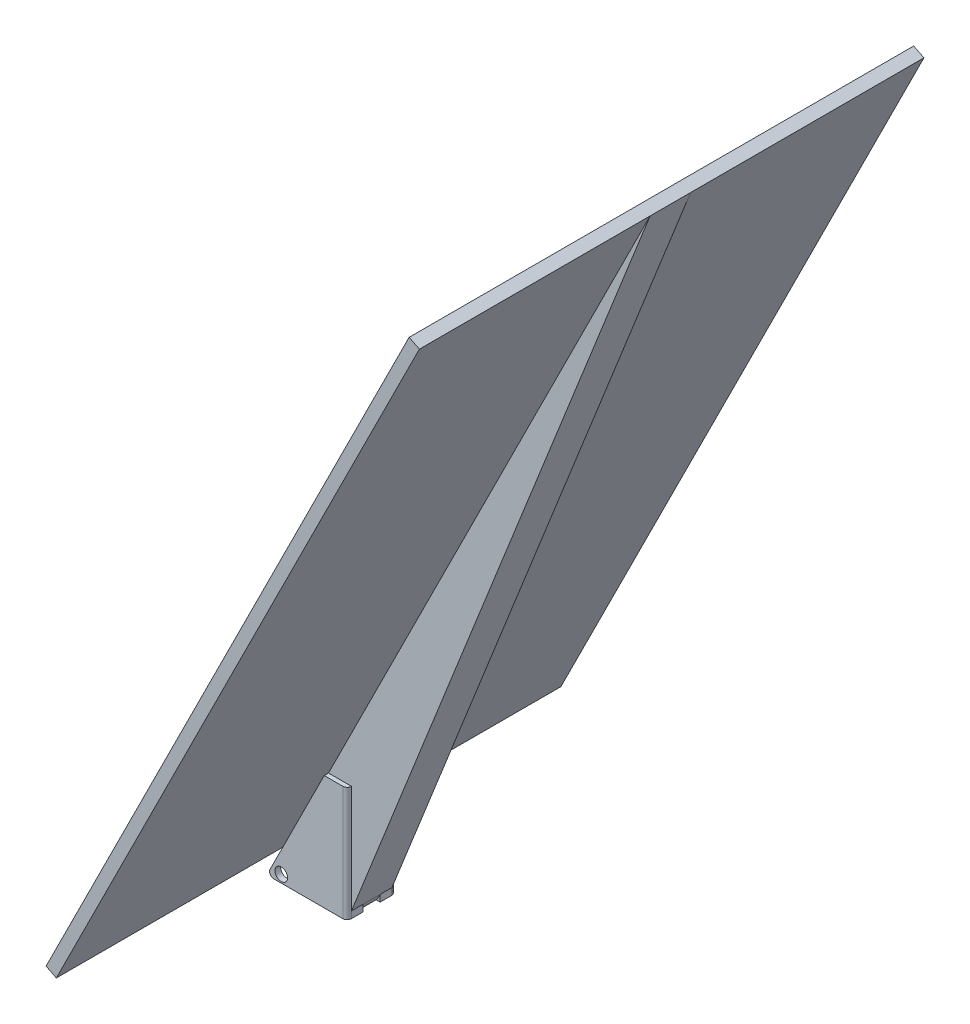
ISO-10303-21;
HEADER;
FILE_DESCRIPTION(('STEP AP214'),'2;1');
FILE_NAME('part.step','',(''),(''),'','','');
FILE_SCHEMA(('AUTOMOTIVE_DESIGN { 1 0 10303 214 1 1 1 1 }'));
ENDSEC;
DATA;
#1=APPLICATION_CONTEXT('core data for automotive mechanical design processes');
#2=APPLICATION_PROTOCOL_DEFINITION('international standard','automotive_design',2000,#1);
#3=PRODUCT_CONTEXT('',#1,'mechanical');
#4=PRODUCT('Part','Part','',(#3));
#5=PRODUCT_RELATED_PRODUCT_CATEGORY('part','',(#4));
#6=PRODUCT_DEFINITION_FORMATION('','',#4);
#7=PRODUCT_DEFINITION_CONTEXT('part definition',#1,'design');
#8=PRODUCT_DEFINITION('design','',#6,#7);
#9=PRODUCT_DEFINITION_SHAPE('','',#8);
#10=(LENGTH_UNIT() NAMED_UNIT(*) SI_UNIT(.MILLI.,.METRE.));
#11=(NAMED_UNIT(*) PLANE_ANGLE_UNIT() SI_UNIT($,.RADIAN.));
#12=(NAMED_UNIT(*) SI_UNIT($,.STERADIAN.) SOLID_ANGLE_UNIT());
#13=UNCERTAINTY_MEASURE_WITH_UNIT(LENGTH_MEASURE(1.E-05),#10,'distance_accuracy_value','');
#14=(GEOMETRIC_REPRESENTATION_CONTEXT(3) GLOBAL_UNCERTAINTY_ASSIGNED_CONTEXT((#13)) GLOBAL_UNIT_ASSIGNED_CONTEXT((#10,
#11,#12)) REPRESENTATION_CONTEXT('',''));
#15=CARTESIAN_POINT('',(0.,0.,0.));
#16=DIRECTION('',(0.,0.,1.));
#17=DIRECTION('',(1.,0.,0.));
#18=AXIS2_PLACEMENT_3D('',#15,#16,#17);
#19=CARTESIAN_POINT('',(23.6636759770968,-11.8318379885484,0.));
#20=DIRECTION('',(-0.894427190999916,0.447213595499958,0.));
#21=DIRECTION('',(-0.447213595499958,-0.894427190999916,0.));
#22=AXIS2_PLACEMENT_3D('',#19,#20,#21);
#23=PLANE('',#22);
#24=DIRECTION('',(0.447213595499958,0.894427190999916,0.));
#25=VECTOR('',#24,1.);
#26=CARTESIAN_POINT('',(8.0426759770968,-43.0738379885484,2.20317749156085));
#27=LINE('',#26,#25);
#28=CARTESIAN_POINT('',(9.51842238139554,-40.1223451799509,2.20317749156085));
#29=VERTEX_POINT('',#28);
#30=CARTESIAN_POINT('',(9.52500000000025,-40.1091899427415,2.20317749156085));
#31=VERTEX_POINT('',#30);
#32=EDGE_CURVE('E401',#29,#31,#27,.T.);
#33=ORIENTED_EDGE('',*,*,#32,.T.);
#34=DIRECTION('',(0.,0.,1.));
#35=VECTOR('',#34,1.);
#36=CARTESIAN_POINT('',(9.525,-40.109189942742,-127.));
#37=LINE('',#36,#35);
#38=CARTESIAN_POINT('',(9.525,-40.109189942742,2.37999999999999));
#39=VERTEX_POINT('',#38);
#40=EDGE_CURVE('E53',#31,#39,#37,.T.);
#41=ORIENTED_EDGE('',*,*,#40,.T.);
#42=CARTESIAN_POINT('',(7.145,-44.869189942742,2.38));
#43=DIRECTION('',(-0.894427190999916,0.447213595499958,0.));
#44=DIRECTION('',(-0.447213595499958,-0.894427190999916,0.));
#45=AXIS2_PLACEMENT_3D('',#42,#43,#44);
#46=ELLIPSE('',#45,5.3218417864495,2.38);
#47=EDGE_CURVE('E428',#29,#39,#46,.F.);
#48=ORIENTED_EDGE('',*,*,#47,.F.);
#49=EDGE_LOOP('',(#33,#41,#48));
#50=FACE_BOUND('',#49,.T.);
#51=ADVANCED_FACE('F38',(#50),#23,.F.);
#52=CARTESIAN_POINT('',(9.525,19.685,26.9875));
#53=DIRECTION('',(0.,-1.,0.));
#54=DIRECTION('',(0.,0.,-1.));
#55=AXIS2_PLACEMENT_3D('',#52,#53,#54);
#56=PLANE('',#55);
#57=DIRECTION('',(1.,0.,0.));
#58=VECTOR('',#57,1.);
#59=CARTESIAN_POINT('',(9.525,19.685,24.6075));
#60=LINE('',#59,#58);
#61=CARTESIAN_POINT('',(-3.175,19.685,24.6075));
#62=VERTEX_POINT('',#61);
#63=CARTESIAN_POINT('',(9.525,19.685,24.6075));
#64=VERTEX_POINT('',#63);
#65=EDGE_CURVE('E421',#62,#64,#60,.T.);
#66=ORIENTED_EDGE('',*,*,#65,.F.);
#67=DIRECTION('',(0.,0.,-1.));
#68=VECTOR('',#67,1.);
#69=CARTESIAN_POINT('',(-3.175,19.685,26.9875));
#70=LINE('',#69,#68);
#71=CARTESIAN_POINT('',(-3.175,19.685,26.9875));
#72=VERTEX_POINT('',#71);
#73=EDGE_CURVE('E242',#72,#62,#70,.T.);
#74=ORIENTED_EDGE('',*,*,#73,.F.);
#75=DIRECTION('',(-1.,0.,0.));
#76=VECTOR('',#75,1.);
#77=CARTESIAN_POINT('',(9.525,19.685,26.9875));
#78=LINE('',#77,#76);
#79=CARTESIAN_POINT('',(7.145,19.685,26.9875));
#80=VERTEX_POINT('',#79);
#81=EDGE_CURVE('E315',#80,#72,#78,.T.);
#82=ORIENTED_EDGE('',*,*,#81,.F.);
#83=CARTESIAN_POINT('',(7.145,19.685,24.6075));
#84=DIRECTION('',(0.,-1.,0.));
#85=DIRECTION('',(0.,0.,-1.));
#86=AXIS2_PLACEMENT_3D('',#83,#84,#85);
#87=CIRCLE('',#86,2.38);
#88=EDGE_CURVE('E342',#80,#64,#87,.F.);
#89=ORIENTED_EDGE('',*,*,#88,.T.);
#90=EDGE_LOOP('',(#66,#74,#82,#89));
#91=FACE_BOUND('',#90,.T.);
#92=ADVANCED_FACE('F478',(#91),#56,.F.);
#93=DIRECTION('',(-1.,0.,0.));
#94=VECTOR('',#93,1.);
#95=CARTESIAN_POINT('',(9.525,19.685,2.20317749156085));
#96=LINE('',#95,#94);
#97=CARTESIAN_POINT('',(9.51842238139554,19.685,2.20317749156085));
#98=VERTEX_POINT('',#97);
#99=CARTESIAN_POINT('',(-3.175,19.685,2.20317749156085));
#100=VERTEX_POINT('',#99);
#101=EDGE_CURVE('E408',#98,#100,#96,.T.);
#102=ORIENTED_EDGE('',*,*,#101,.F.);
#103=CARTESIAN_POINT('',(7.145,19.685,2.38));
#104=DIRECTION('',(0.,-1.,0.));
#105=DIRECTION('',(0.,0.,-1.));
#106=AXIS2_PLACEMENT_3D('',#103,#104,#105);
#107=CIRCLE('',#106,2.38);
#108=CARTESIAN_POINT('',(7.145,19.685,0.));
#109=VERTEX_POINT('',#108);
#110=EDGE_CURVE('E345',#98,#109,#107,.F.);
#111=ORIENTED_EDGE('',*,*,#110,.T.);
#112=DIRECTION('',(-1.,0.,0.));
#113=VECTOR('',#112,1.);
#114=CARTESIAN_POINT('',(9.525,19.685,0.));
#115=LINE('',#114,#113);
#116=CARTESIAN_POINT('',(-3.175,19.685,0.));
#117=VERTEX_POINT('',#116);
#118=EDGE_CURVE('E314',#109,#117,#115,.T.);
#119=ORIENTED_EDGE('',*,*,#118,.T.);
#120=EDGE_CURVE('E333',#100,#117,#70,.T.);
#121=ORIENTED_EDGE('',*,*,#120,.F.);
#122=EDGE_LOOP('',(#102,#111,#119,#121));
#123=FACE_BOUND('',#122,.T.);
#124=ADVANCED_FACE('F484',(#123),#56,.F.);
#125=CARTESIAN_POINT('',(9.525,-43.815,26.9875));
#126=DIRECTION('',(-1.,0.,0.));
#127=DIRECTION('',(0.,0.,1.));
#128=AXIS2_PLACEMENT_3D('',#125,#126,#127);
#129=PLANE('',#128);
#130=DIRECTION('',(0.,0.,-1.));
#131=VECTOR('',#130,1.);
#132=CARTESIAN_POINT('',(9.525,-40.109189942742,26.9875));
#133=LINE('',#132,#131);
#134=CARTESIAN_POINT('',(9.525,-40.109189942742,24.6075));
#135=VERTEX_POINT('',#134);
#136=CARTESIAN_POINT('',(9.525,-40.109189942742,18.25625));
#137=VERTEX_POINT('',#136);
#138=EDGE_CURVE('E423',#135,#137,#133,.T.);
#139=ORIENTED_EDGE('',*,*,#138,.F.);
#140=DIRECTION('',(0.,1.,0.));
#141=VECTOR('',#140,1.);
#142=CARTESIAN_POINT('',(9.525,-43.815,24.6075));
#143=LINE('',#142,#141);
#144=CARTESIAN_POINT('',(9.525,-43.815,24.6075));
#145=VERTEX_POINT('',#144);
#146=EDGE_CURVE('E335',#135,#145,#143,.F.);
#147=ORIENTED_EDGE('',*,*,#146,.T.);
#148=DIRECTION('',(0.,0.,-1.));
#149=VECTOR('',#148,1.);
#150=CARTESIAN_POINT('',(9.525,-43.815,26.9875));
#151=LINE('',#150,#149);
#152=CARTESIAN_POINT('',(9.525,-43.815,18.25625));
#153=VERTEX_POINT('',#152);
#154=EDGE_CURVE('E330',#145,#153,#151,.T.);
#155=ORIENTED_EDGE('',*,*,#154,.T.);
#156=DIRECTION('',(0.,-1.,0.));
#157=VECTOR('',#156,1.);
#158=CARTESIAN_POINT('',(9.525,-43.815,18.25625));
#159=LINE('',#158,#157);
#160=EDGE_CURVE('E273',#137,#153,#159,.T.);
#161=ORIENTED_EDGE('',*,*,#160,.F.);
#162=EDGE_LOOP('',(#139,#147,#155,#161));
#163=FACE_BOUND('',#162,.T.);
#164=ADVANCED_FACE('F550',(#163),#129,.F.);
#165=CARTESIAN_POINT('',(9.525,-40.109189942742,8.73125));
#166=VERTEX_POINT('',#165);
#167=EDGE_CURVE('E426',#166,#39,#133,.T.);
#168=ORIENTED_EDGE('',*,*,#167,.F.);
#169=DIRECTION('',(0.,1.,0.));
#170=VECTOR('',#169,1.);
#171=CARTESIAN_POINT('',(9.525,-43.815,8.73125));
#172=LINE('',#171,#170);
#173=CARTESIAN_POINT('',(9.525,-43.815,8.73125));
#174=VERTEX_POINT('',#173);
#175=EDGE_CURVE('E275',#174,#166,#172,.T.);
#176=ORIENTED_EDGE('',*,*,#175,.F.);
#177=CARTESIAN_POINT('',(9.525,-43.815,2.38));
#178=VERTEX_POINT('',#177);
#179=EDGE_CURVE('E322',#174,#178,#151,.T.);
#180=ORIENTED_EDGE('',*,*,#179,.T.);
#181=DIRECTION('',(0.,1.,0.));
#182=VECTOR('',#181,1.);
#183=CARTESIAN_POINT('',(9.525,19.685,2.38));
#184=LINE('',#183,#182);
#185=EDGE_CURVE('E339',#178,#39,#184,.T.);
#186=ORIENTED_EDGE('',*,*,#185,.T.);
#187=EDGE_LOOP('',(#168,#176,#180,#186));
#188=FACE_BOUND('',#187,.T.);
#189=ADVANCED_FACE('F532',(#188),#129,.F.);
#190=CARTESIAN_POINT('',(-34.925,-43.815,3.175));
#191=DIRECTION('',(0.,0.,-1.));
#192=DIRECTION('',(-1.,0.,0.));
#193=AXIS2_PLACEMENT_3D('',#190,#191,#192);
#194=PLANE('',#193);
#195=CARTESIAN_POINT('',(-26.9654927076154,-39.5437225605806,3.175));
#196=DIRECTION('',(0.,0.,-1.));
#197=DIRECTION('',(-1.,0.,0.));
#198=AXIS2_PLACEMENT_3D('',#195,#196,#197);
#199=CIRCLE('',#198,3.49885);
#200=CARTESIAN_POINT('',(-30.4643427076154,-39.5437225605806,3.175));
#201=VERTEX_POINT('',#200);
#202=EDGE_CURVE('E290',#201,#201,#199,.T.);
#203=ORIENTED_EDGE('',*,*,#202,.T.);
#204=EDGE_LOOP('',(#203));
#205=FACE_BOUND('',#204,.T.);
#206=DIRECTION('',(0.894427190999916,-0.447213595499958,0.));
#207=VECTOR('',#206,1.);
#208=CARTESIAN_POINT('',(-26.035,-26.035,3.175));
#209=LINE('',#208,#207);
#210=CARTESIAN_POINT('',(-26.035,-26.035,3.175));
#211=VERTEX_POINT('',#210);
#212=CARTESIAN_POINT('',(6.34999999999999,-42.2275,3.175));
#213=VERTEX_POINT('',#212);
#214=EDGE_CURVE('E419',#211,#213,#209,.T.);
#215=ORIENTED_EDGE('',*,*,#214,.F.);
#216=DIRECTION('',(-0.447213595499958,-0.894427190999916,0.));
#217=VECTOR('',#216,1.);
#218=CARTESIAN_POINT('',(-34.925,-43.815,3.175));
#219=LINE('',#218,#217);
#220=CARTESIAN_POINT('',(-26.1032999927932,-26.1715999855864,3.175));
#221=VERTEX_POINT('',#220);
#222=EDGE_CURVE('E271',#211,#221,#219,.T.);
#223=ORIENTED_EDGE('',*,*,#222,.T.);
#224=DIRECTION('',(0.447213595499958,0.894427190999916,0.));
#225=VECTOR('',#224,1.);
#226=CARTESIAN_POINT('',(-3.175,19.685,3.175));
#227=LINE('',#226,#225);
#228=CARTESIAN_POINT('',(-33.2028158213551,-40.3706316427101,3.175));
#229=VERTEX_POINT('',#228);
#230=EDGE_CURVE('E311',#229,#221,#227,.T.);
#231=ORIENTED_EDGE('',*,*,#230,.F.);
#232=CARTESIAN_POINT('',(-31.0740791067752,-41.435,3.175));
#233=DIRECTION('',(0.,0.,-1.));
#234=DIRECTION('',(-1.,0.,0.));
#235=AXIS2_PLACEMENT_3D('',#232,#233,#234);
#236=CIRCLE('',#235,2.38);
#237=CARTESIAN_POINT('',(-31.0740791067752,-43.815,3.175));
#238=VERTEX_POINT('',#237);
#239=EDGE_CURVE('E370',#229,#238,#236,.F.);
#240=ORIENTED_EDGE('',*,*,#239,.T.);
#241=DIRECTION('',(-1.,0.,0.));
#242=VECTOR('',#241,1.);
#243=CARTESIAN_POINT('',(-34.925,-43.815,3.175));
#244=LINE('',#243,#242);
#245=CARTESIAN_POINT('',(6.34999999999999,-43.815,3.175));
#246=VERTEX_POINT('',#245);
#247=EDGE_CURVE('E299',#246,#238,#244,.T.);
#248=ORIENTED_EDGE('',*,*,#247,.F.);
#249=DIRECTION('',(0.,1.,0.));
#250=VECTOR('',#249,1.);
#251=CARTESIAN_POINT('',(6.34999999999999,-43.815,3.175));
#252=LINE('',#251,#250);
#253=EDGE_CURVE('E303',#246,#213,#252,.T.);
#254=ORIENTED_EDGE('',*,*,#253,.T.);
#255=EDGE_LOOP('',(#215,#223,#231,#240,#248,#254));
#256=FACE_BOUND('',#255,.T.);
#257=ADVANCED_FACE('F529',(#205,#256),#194,.F.);
#258=CARTESIAN_POINT('',(6.35,-43.815,23.8125));
#259=DIRECTION('',(0.,0.,1.));
#260=DIRECTION('',(1.,0.,0.));
#261=AXIS2_PLACEMENT_3D('',#258,#259,#260);
#262=PLANE('',#261);
#263=CARTESIAN_POINT('',(-26.9654927076154,-39.5437225605806,23.8125));
#264=DIRECTION('',(0.,0.,1.));
#265=DIRECTION('',(1.,0.,0.));
#266=AXIS2_PLACEMENT_3D('',#263,#264,#265);
#267=CIRCLE('',#266,3.49885);
#268=CARTESIAN_POINT('',(-23.4666427076154,-39.5437225605806,23.8125));
#269=VERTEX_POINT('',#268);
#270=EDGE_CURVE('E287',#269,#269,#267,.T.);
#271=ORIENTED_EDGE('',*,*,#270,.T.);
#272=EDGE_LOOP('',(#271));
#273=FACE_BOUND('',#272,.T.);
#274=DIRECTION('',(-0.894427190999916,0.447213595499958,0.));
#275=VECTOR('',#274,1.);
#276=CARTESIAN_POINT('',(6.985,-42.545,23.8125));
#277=LINE('',#276,#275);
#278=CARTESIAN_POINT('',(6.35,-42.2275,23.8125));
#279=VERTEX_POINT('',#278);
#280=CARTESIAN_POINT('',(-26.035,-26.035,23.8125));
#281=VERTEX_POINT('',#280);
#282=EDGE_CURVE('E410',#279,#281,#277,.T.);
#283=ORIENTED_EDGE('',*,*,#282,.F.);
#284=DIRECTION('',(0.,1.,0.));
#285=VECTOR('',#284,1.);
#286=CARTESIAN_POINT('',(6.35,-43.815,23.8125));
#287=LINE('',#286,#285);
#288=CARTESIAN_POINT('',(6.35,-43.815,23.8125));
#289=VERTEX_POINT('',#288);
#290=EDGE_CURVE('E302',#289,#279,#287,.T.);
#291=ORIENTED_EDGE('',*,*,#290,.F.);
#292=DIRECTION('',(1.,0.,0.));
#293=VECTOR('',#292,1.);
#294=CARTESIAN_POINT('',(6.35,-43.815,23.8125));
#295=LINE('',#294,#293);
#296=CARTESIAN_POINT('',(-31.0740791067752,-43.815,23.8125));
#297=VERTEX_POINT('',#296);
#298=EDGE_CURVE('E293',#297,#289,#295,.T.);
#299=ORIENTED_EDGE('',*,*,#298,.F.);
#300=CARTESIAN_POINT('',(-31.0740791067752,-41.435,23.8125));
#301=DIRECTION('',(0.,0.,1.));
#302=DIRECTION('',(1.,0.,0.));
#303=AXIS2_PLACEMENT_3D('',#300,#301,#302);
#304=CIRCLE('',#303,2.38);
#305=CARTESIAN_POINT('',(-33.2028158213551,-40.3706316427101,23.8125));
#306=VERTEX_POINT('',#305);
#307=EDGE_CURVE('E372',#297,#306,#304,.F.);
#308=ORIENTED_EDGE('',*,*,#307,.T.);
#309=DIRECTION('',(-0.447213595499958,-0.894427190999916,0.));
#310=VECTOR('',#309,1.);
#311=CARTESIAN_POINT('',(-3.175,19.685,23.8125));
#312=LINE('',#311,#310);
#313=CARTESIAN_POINT('',(-26.1032999927932,-26.1715999855864,23.8125));
#314=VERTEX_POINT('',#313);
#315=EDGE_CURVE('E306',#314,#306,#312,.T.);
#316=ORIENTED_EDGE('',*,*,#315,.F.);
#317=EDGE_CURVE('E309',#281,#314,#312,.T.);
#318=ORIENTED_EDGE('',*,*,#317,.F.);
#319=EDGE_LOOP('',(#283,#291,#299,#308,#316,#318));
#320=FACE_BOUND('',#319,.T.);
#321=ADVANCED_FACE('F459',(#273,#320),#262,.F.);
#322=CARTESIAN_POINT('',(6.34999999999999,-43.815,3.175));
#323=DIRECTION('',(1.,0.,0.));
#324=DIRECTION('',(0.,0.,-1.));
#325=AXIS2_PLACEMENT_3D('',#322,#323,#324);
#326=PLANE('',#325);
#327=DIRECTION('',(0.,0.,1.));
#328=VECTOR('',#327,1.);
#329=CARTESIAN_POINT('',(6.34999999999999,-42.2275,3.175));
#330=LINE('',#329,#328);
#331=CARTESIAN_POINT('',(6.34999999999999,-42.2275,8.73125));
#332=VERTEX_POINT('',#331);
#333=EDGE_CURVE('E412',#213,#332,#330,.T.);
#334=ORIENTED_EDGE('',*,*,#333,.F.);
#335=ORIENTED_EDGE('',*,*,#253,.F.);
#336=DIRECTION('',(0.,0.,-1.));
#337=VECTOR('',#336,1.);
#338=CARTESIAN_POINT('',(6.34999999999999,-43.815,3.175));
#339=LINE('',#338,#337);
#340=CARTESIAN_POINT('',(6.34999999999999,-43.815,8.73125));
#341=VERTEX_POINT('',#340);
#342=EDGE_CURVE('E295',#341,#246,#339,.T.);
#343=ORIENTED_EDGE('',*,*,#342,.F.);
#344=DIRECTION('',(0.,1.,0.));
#345=VECTOR('',#344,1.);
#346=CARTESIAN_POINT('',(6.35,-43.815,8.73125));
#347=LINE('',#346,#345);
#348=EDGE_CURVE('E381',#341,#332,#347,.T.);
#349=ORIENTED_EDGE('',*,*,#348,.T.);
#350=EDGE_LOOP('',(#334,#335,#343,#349));
#351=FACE_BOUND('',#350,.T.);
#352=ADVANCED_FACE('F534',(#351),#326,.F.);
#353=CARTESIAN_POINT('',(6.35,-42.2275,18.25625));
#354=VERTEX_POINT('',#353);
#355=EDGE_CURVE('E407',#354,#279,#330,.T.);
#356=ORIENTED_EDGE('',*,*,#355,.F.);
#357=DIRECTION('',(0.,-1.,0.));
#358=VECTOR('',#357,1.);
#359=CARTESIAN_POINT('',(6.35,-43.815,18.25625));
#360=LINE('',#359,#358);
#361=CARTESIAN_POINT('',(6.35,-43.815,18.25625));
#362=VERTEX_POINT('',#361);
#363=EDGE_CURVE('E379',#354,#362,#360,.T.);
#364=ORIENTED_EDGE('',*,*,#363,.T.);
#365=EDGE_CURVE('E296',#289,#362,#339,.T.);
#366=ORIENTED_EDGE('',*,*,#365,.F.);
#367=ORIENTED_EDGE('',*,*,#290,.T.);
#368=EDGE_LOOP('',(#356,#364,#366,#367));
#369=FACE_BOUND('',#368,.T.);
#370=ADVANCED_FACE('F537',(#369),#326,.F.);
#371=CARTESIAN_POINT('',(7.145,-43.815,2.38));
#372=DIRECTION('',(0.,-1.,0.));
#373=DIRECTION('',(0.,0.,-1.));
#374=AXIS2_PLACEMENT_3D('',#371,#372,#373);
#375=CYLINDRICAL_SURFACE('',#374,2.38);
#376=ORIENTED_EDGE('',*,*,#110,.F.);
#377=DIRECTION('',(0.,-1.,0.));
#378=VECTOR('',#377,1.);
#379=CARTESIAN_POINT('',(9.51842238139554,-43.815,2.20317749156085));
#380=LINE('',#379,#378);
#381=EDGE_CURVE('E413',#98,#29,#380,.T.);
#382=ORIENTED_EDGE('',*,*,#381,.T.);
#383=ORIENTED_EDGE('',*,*,#47,.T.);
#384=ORIENTED_EDGE('',*,*,#185,.F.);
#385=CARTESIAN_POINT('',(7.145,-43.815,2.38));
#386=DIRECTION('',(0.,1.,0.));
#387=DIRECTION('',(0.,0.,1.));
#388=AXIS2_PLACEMENT_3D('',#385,#386,#387);
#389=CIRCLE('',#388,2.38);
#390=CARTESIAN_POINT('',(7.145,-43.815,0.));
#391=VERTEX_POINT('',#390);
#392=EDGE_CURVE('E353',#391,#178,#389,.F.);
#393=ORIENTED_EDGE('',*,*,#392,.F.);
#394=DIRECTION('',(0.,1.,0.));
#395=VECTOR('',#394,1.);
#396=CARTESIAN_POINT('',(7.145,-43.815,0.));
#397=LINE('',#396,#395);
#398=EDGE_CURVE('E347',#109,#391,#397,.F.);
#399=ORIENTED_EDGE('',*,*,#398,.F.);
#400=EDGE_LOOP('',(#376,#382,#383,#384,#393,#399));
#401=FACE_BOUND('',#400,.T.);
#402=ADVANCED_FACE('F519',(#401),#375,.T.);
#403=CARTESIAN_POINT('',(-33.4540791067752,-43.815,8.73125));
#404=DIRECTION('',(0.,0.,-1.));
#405=DIRECTION('',(-1.,0.,0.));
#406=AXIS2_PLACEMENT_3D('',#403,#404,#405);
#407=PLANE('',#406);
#408=DIRECTION('',(0.894427190999916,-0.447213595499958,0.));
#409=VECTOR('',#408,1.);
#410=CARTESIAN_POINT('',(-24.8582632854202,-26.6233683572899,8.73125));
#411=LINE('',#410,#409);
#412=CARTESIAN_POINT('',(8.0426759770968,-43.0738379885484,8.73125));
#413=VERTEX_POINT('',#412);
#414=EDGE_CURVE('E400',#332,#413,#411,.T.);
#415=ORIENTED_EDGE('',*,*,#414,.F.);
#416=ORIENTED_EDGE('',*,*,#348,.F.);
#417=DIRECTION('',(1.,0.,0.));
#418=VECTOR('',#417,1.);
#419=CARTESIAN_POINT('',(-33.4540791067752,-43.815,8.73125));
#420=LINE('',#419,#418);
#421=EDGE_CURVE('E279',#341,#174,#420,.T.);
#422=ORIENTED_EDGE('',*,*,#421,.T.);
#423=ORIENTED_EDGE('',*,*,#175,.T.);
#424=DIRECTION('',(0.447213595499958,0.894427190999916,0.));
#425=VECTOR('',#424,1.);
#426=CARTESIAN_POINT('',(-0.553139844258248,-60.2654696312585,8.73125));
#427=LINE('',#426,#425);
#428=EDGE_CURVE('E425',#413,#166,#427,.T.);
#429=ORIENTED_EDGE('',*,*,#428,.F.);
#430=EDGE_LOOP('',(#415,#416,#422,#423,#429));
#431=FACE_BOUND('',#430,.T.);
#432=ADVANCED_FACE('F516',(#431),#407,.F.);
#433=CARTESIAN_POINT('',(-33.4540791067752,-43.815,18.25625));
#434=DIRECTION('',(0.,0.,1.));
#435=DIRECTION('',(0.,-1.,0.));
#436=AXIS2_PLACEMENT_3D('',#433,#434,#435);
#437=PLANE('',#436);
#438=DIRECTION('',(-0.894427190999916,0.447213595499958,0.));
#439=VECTOR('',#438,1.);
#440=CARTESIAN_POINT('',(-24.8582632854202,-26.6233683572899,18.25625));
#441=LINE('',#440,#439);
#442=CARTESIAN_POINT('',(8.0426759770968,-43.0738379885484,18.25625));
#443=VERTEX_POINT('',#442);
#444=EDGE_CURVE('E397',#443,#354,#441,.T.);
#445=ORIENTED_EDGE('',*,*,#444,.F.);
#446=DIRECTION('',(-0.447213595499958,-0.894427190999916,0.));
#447=VECTOR('',#446,1.);
#448=CARTESIAN_POINT('',(-0.553139844258248,-60.2654696312585,18.25625));
#449=LINE('',#448,#447);
#450=EDGE_CURVE('E46',#137,#443,#449,.T.);
#451=ORIENTED_EDGE('',*,*,#450,.F.);
#452=ORIENTED_EDGE('',*,*,#160,.T.);
#453=DIRECTION('',(1.,0.,0.));
#454=VECTOR('',#453,1.);
#455=CARTESIAN_POINT('',(-33.4540791067752,-43.815,18.25625));
#456=LINE('',#455,#454);
#457=EDGE_CURVE('E278',#362,#153,#456,.T.);
#458=ORIENTED_EDGE('',*,*,#457,.F.);
#459=ORIENTED_EDGE('',*,*,#363,.F.);
#460=EDGE_LOOP('',(#445,#451,#452,#458,#459));
#461=FACE_BOUND('',#460,.T.);
#462=ADVANCED_FACE('F405',(#461),#437,.F.);
#463=CARTESIAN_POINT('',(-10.414,5.20700000000001,0.));
#464=DIRECTION('',(0.894427190999916,-0.447213595499958,0.));
#465=DIRECTION('',(0.447213595499958,0.894427190999916,0.));
#466=AXIS2_PLACEMENT_3D('',#463,#464,#465);
#467=PLANE('',#466);
#468=ORIENTED_EDGE('',*,*,#73,.T.);
#469=DIRECTION('',(-0.447213595499958,-0.894427190999916,0.));
#470=VECTOR('',#469,1.);
#471=CARTESIAN_POINT('',(-26.035,-26.035,24.6075));
#472=LINE('',#471,#470);
#473=CARTESIAN_POINT('',(174.954988272078,375.944976544156,24.6075));
#474=VERTEX_POINT('',#473);
#475=EDGE_CURVE('E228',#474,#62,#472,.T.);
#476=ORIENTED_EDGE('',*,*,#475,.F.);
#477=DIRECTION('',(0.,0.,-1.));
#478=VECTOR('',#477,1.);
#479=CARTESIAN_POINT('',(174.954988272078,375.944976544156,-127.));
#480=LINE('',#479,#478);
#481=CARTESIAN_POINT('',(174.954988272078,375.944976544156,152.4));
#482=VERTEX_POINT('',#481);
#483=EDGE_CURVE('E239',#482,#474,#480,.T.);
#484=ORIENTED_EDGE('',*,*,#483,.F.);
#485=DIRECTION('',(0.447213595499958,0.894427190999916,0.));
#486=VECTOR('',#485,1.);
#487=CARTESIAN_POINT('',(-26.1032999927932,-26.1715999855864,152.4));
#488=LINE('',#487,#486);
#489=CARTESIAN_POINT('',(-26.1032999927932,-26.1715999855864,152.4));
#490=VERTEX_POINT('',#489);
#491=EDGE_CURVE('E256',#490,#482,#488,.T.);
#492=ORIENTED_EDGE('',*,*,#491,.F.);
#493=DIRECTION('',(0.,0.,1.));
#494=VECTOR('',#493,1.);
#495=CARTESIAN_POINT('',(-26.1032999927932,-26.1715999855864,-127.));
#496=LINE('',#495,#494);
#497=CARTESIAN_POINT('',(-26.1032999927932,-26.1715999855864,26.9875));
#498=VERTEX_POINT('',#497);
#499=EDGE_CURVE('E437',#498,#490,#496,.T.);
#500=ORIENTED_EDGE('',*,*,#499,.F.);
#501=DIRECTION('',(-0.447213595499958,-0.894427190999916,0.));
#502=VECTOR('',#501,1.);
#503=CARTESIAN_POINT('',(-3.175,19.685,26.9875));
#504=LINE('',#503,#502);
#505=EDGE_CURVE('E318',#72,#498,#504,.T.);
#506=ORIENTED_EDGE('',*,*,#505,.F.);
#507=EDGE_LOOP('',(#468,#476,#484,#492,#500,#506));
#508=FACE_BOUND('',#507,.T.);
#509=ADVANCED_FACE('F237',(#508),#467,.T.);
#510=ORIENTED_EDGE('',*,*,#222,.F.);
#511=DIRECTION('',(0.,0.,-1.));
#512=VECTOR('',#511,1.);
#513=CARTESIAN_POINT('',(-26.035,-26.035,24.6075));
#514=LINE('',#513,#512);
#515=EDGE_CURVE('E243',#281,#211,#514,.T.);
#516=ORIENTED_EDGE('',*,*,#515,.F.);
#517=ORIENTED_EDGE('',*,*,#317,.T.);
#518=EDGE_CURVE('E443',#221,#314,#496,.T.);
#519=ORIENTED_EDGE('',*,*,#518,.F.);
#520=EDGE_LOOP('',(#510,#516,#517,#519));
#521=FACE_BOUND('',#520,.T.);
#522=ADVANCED_FACE('F453',(#521),#467,.T.);
#523=CARTESIAN_POINT('',(174.954988272078,375.944976544156,2.20317749156085));
#524=VERTEX_POINT('',#523);
#525=CARTESIAN_POINT('',(174.954988272078,375.944976544156,-127.));
#526=VERTEX_POINT('',#525);
#527=EDGE_CURVE('E251',#524,#526,#480,.T.);
#528=ORIENTED_EDGE('',*,*,#527,.F.);
#529=DIRECTION('',(0.447213595499958,0.894427190999916,0.));
#530=VECTOR('',#529,1.);
#531=CARTESIAN_POINT('',(-26.035,-26.035,2.20317749156085));
#532=LINE('',#531,#530);
#533=EDGE_CURVE('E402',#100,#524,#532,.T.);
#534=ORIENTED_EDGE('',*,*,#533,.F.);
#535=ORIENTED_EDGE('',*,*,#120,.T.);
#536=DIRECTION('',(-0.447213595499958,-0.894427190999916,0.));
#537=VECTOR('',#536,1.);
#538=CARTESIAN_POINT('',(-3.175,19.685,0.));
#539=LINE('',#538,#537);
#540=CARTESIAN_POINT('',(-26.1032999927932,-26.1715999855864,0.));
#541=VERTEX_POINT('',#540);
#542=EDGE_CURVE('E326',#117,#541,#539,.T.);
#543=ORIENTED_EDGE('',*,*,#542,.T.);
#544=CARTESIAN_POINT('',(-26.1032999927932,-26.1715999855864,-127.));
#545=VERTEX_POINT('',#544);
#546=EDGE_CURVE('E438',#545,#541,#496,.T.);
#547=ORIENTED_EDGE('',*,*,#546,.F.);
#548=DIRECTION('',(-0.447213595499958,-0.894427190999916,0.));
#549=VECTOR('',#548,1.);
#550=CARTESIAN_POINT('',(-26.1032999927932,-26.1715999855864,-127.));
#551=LINE('',#550,#549);
#552=EDGE_CURVE('E430',#526,#545,#551,.T.);
#553=ORIENTED_EDGE('',*,*,#552,.F.);
#554=EDGE_LOOP('',(#528,#534,#535,#543,#547,#553));
#555=FACE_BOUND('',#554,.T.);
#556=ADVANCED_FACE('F474',(#555),#467,.T.);
#557=CARTESIAN_POINT('',(-3.175,19.685,26.9875));
#558=DIRECTION('',(0.894427190999916,-0.447213595499958,0.));
#559=DIRECTION('',(0.447213595499958,0.894427190999916,0.));
#560=AXIS2_PLACEMENT_3D('',#557,#558,#559);
#561=PLANE('',#560);
#562=EDGE_CURVE('E440',#541,#221,#496,.T.);
#563=ORIENTED_EDGE('',*,*,#562,.F.);
#564=CARTESIAN_POINT('',(-33.2028158213551,-40.3706316427101,0.));
#565=VERTEX_POINT('',#564);
#566=EDGE_CURVE('E325',#541,#565,#539,.T.);
#567=ORIENTED_EDGE('',*,*,#566,.T.);
#568=DIRECTION('',(0.,0.,-1.));
#569=VECTOR('',#568,1.);
#570=CARTESIAN_POINT('',(-33.2028158213551,-40.3706316427101,26.9875));
#571=LINE('',#570,#569);
#572=EDGE_CURVE('E368',#565,#229,#571,.F.);
#573=ORIENTED_EDGE('',*,*,#572,.T.);
#574=ORIENTED_EDGE('',*,*,#230,.T.);
#575=EDGE_LOOP('',(#563,#567,#573,#574));
#576=FACE_BOUND('',#575,.T.);
#577=ADVANCED_FACE('F465',(#576),#561,.F.);
#578=EDGE_CURVE('E444',#314,#498,#496,.T.);
#579=ORIENTED_EDGE('',*,*,#578,.F.);
#580=ORIENTED_EDGE('',*,*,#315,.T.);
#581=DIRECTION('',(0.,0.,-1.));
#582=VECTOR('',#581,1.);
#583=CARTESIAN_POINT('',(-33.2028158213551,-40.3706316427101,26.9875));
#584=LINE('',#583,#582);
#585=CARTESIAN_POINT('',(-33.2028158213551,-40.3706316427101,26.9875));
#586=VERTEX_POINT('',#585);
#587=EDGE_CURVE('E375',#306,#586,#584,.F.);
#588=ORIENTED_EDGE('',*,*,#587,.T.);
#589=EDGE_CURVE('E60',#498,#586,#504,.T.);
#590=ORIENTED_EDGE('',*,*,#589,.F.);
#591=EDGE_LOOP('',(#579,#580,#588,#590));
#592=FACE_BOUND('',#591,.T.);
#593=ADVANCED_FACE('F462',(#592),#561,.F.);
#594=CARTESIAN_POINT('',(9.525,-43.815,26.9875));
#595=DIRECTION('',(0.,1.,0.));
#596=DIRECTION('',(0.,0.,1.));
#597=AXIS2_PLACEMENT_3D('',#594,#595,#596);
#598=PLANE('',#597);
#599=ORIENTED_EDGE('',*,*,#179,.F.);
#600=ORIENTED_EDGE('',*,*,#421,.F.);
#601=ORIENTED_EDGE('',*,*,#342,.T.);
#602=ORIENTED_EDGE('',*,*,#247,.T.);
#603=DIRECTION('',(0.,0.,-1.));
#604=VECTOR('',#603,1.);
#605=CARTESIAN_POINT('',(-31.0740791067752,-43.815,26.9875));
#606=LINE('',#605,#604);
#607=CARTESIAN_POINT('',(-31.0740791067752,-43.815,0.));
#608=VERTEX_POINT('',#607);
#609=EDGE_CURVE('E362',#238,#608,#606,.T.);
#610=ORIENTED_EDGE('',*,*,#609,.T.);
#611=DIRECTION('',(1.,0.,0.));
#612=VECTOR('',#611,1.);
#613=CARTESIAN_POINT('',(9.525,-43.815,0.));
#614=LINE('',#613,#612);
#615=EDGE_CURVE('E317',#608,#391,#614,.T.);
#616=ORIENTED_EDGE('',*,*,#615,.T.);
#617=ORIENTED_EDGE('',*,*,#392,.T.);
#618=EDGE_LOOP('',(#599,#600,#601,#602,#610,#616,#617));
#619=FACE_BOUND('',#618,.T.);
#620=ADVANCED_FACE('F464',(#619),#598,.F.);
#621=ORIENTED_EDGE('',*,*,#365,.T.);
#622=ORIENTED_EDGE('',*,*,#457,.T.);
#623=ORIENTED_EDGE('',*,*,#154,.F.);
#624=CARTESIAN_POINT('',(7.145,-43.815,24.6075));
#625=DIRECTION('',(0.,1.,0.));
#626=DIRECTION('',(0.,0.,1.));
#627=AXIS2_PLACEMENT_3D('',#624,#625,#626);
#628=CIRCLE('',#627,2.38);
#629=CARTESIAN_POINT('',(7.145,-43.815,26.9875));
#630=VERTEX_POINT('',#629);
#631=EDGE_CURVE('E350',#145,#630,#628,.F.);
#632=ORIENTED_EDGE('',*,*,#631,.T.);
#633=DIRECTION('',(1.,0.,0.));
#634=VECTOR('',#633,1.);
#635=CARTESIAN_POINT('',(9.525,-43.815,26.9875));
#636=LINE('',#635,#634);
#637=CARTESIAN_POINT('',(-31.0740791067752,-43.815,26.9875));
#638=VERTEX_POINT('',#637);
#639=EDGE_CURVE('E320',#638,#630,#636,.T.);
#640=ORIENTED_EDGE('',*,*,#639,.F.);
#641=DIRECTION('',(0.,0.,-1.));
#642=VECTOR('',#641,1.);
#643=CARTESIAN_POINT('',(-31.0740791067752,-43.815,26.9875));
#644=LINE('',#643,#642);
#645=EDGE_CURVE('E359',#638,#297,#644,.T.);
#646=ORIENTED_EDGE('',*,*,#645,.T.);
#647=ORIENTED_EDGE('',*,*,#298,.T.);
#648=EDGE_LOOP('',(#621,#622,#623,#632,#640,#646,#647));
#649=FACE_BOUND('',#648,.T.);
#650=ADVANCED_FACE('F471',(#649),#598,.F.);
#651=CARTESIAN_POINT('',(0.,0.,26.9875));
#652=DIRECTION('',(0.,0.,-1.));
#653=DIRECTION('',(-1.,0.,0.));
#654=AXIS2_PLACEMENT_3D('',#651,#652,#653);
#655=PLANE('',#654);
#656=CARTESIAN_POINT('',(-26.9654927076154,-39.5437225605806,26.9875));
#657=DIRECTION('',(0.,0.,1.));
#658=DIRECTION('',(1.,0.,0.));
#659=AXIS2_PLACEMENT_3D('',#656,#657,#658);
#660=CIRCLE('',#659,3.49885);
#661=CARTESIAN_POINT('',(-23.4666427076154,-39.5437225605806,26.9875));
#662=VERTEX_POINT('',#661);
#663=EDGE_CURVE('E281',#662,#662,#660,.T.);
#664=ORIENTED_EDGE('',*,*,#663,.F.);
#665=EDGE_LOOP('',(#664));
#666=FACE_BOUND('',#665,.T.);
#667=ORIENTED_EDGE('',*,*,#505,.T.);
#668=ORIENTED_EDGE('',*,*,#589,.T.);
#669=CARTESIAN_POINT('',(-31.0740791067752,-41.435,26.9875));
#670=DIRECTION('',(0.,0.,-1.));
#671=DIRECTION('',(-1.,0.,0.));
#672=AXIS2_PLACEMENT_3D('',#669,#670,#671);
#673=CIRCLE('',#672,2.38);
#674=EDGE_CURVE('E377',#586,#638,#673,.F.);
#675=ORIENTED_EDGE('',*,*,#674,.T.);
#676=ORIENTED_EDGE('',*,*,#639,.T.);
#677=DIRECTION('',(0.,1.,0.));
#678=VECTOR('',#677,1.);
#679=CARTESIAN_POINT('',(7.145,0.,26.9875));
#680=LINE('',#679,#678);
#681=EDGE_CURVE('E356',#630,#80,#680,.T.);
#682=ORIENTED_EDGE('',*,*,#681,.T.);
#683=ORIENTED_EDGE('',*,*,#81,.T.);
#684=EDGE_LOOP('',(#667,#668,#675,#676,#682,#683));
#685=FACE_BOUND('',#684,.T.);
#686=ADVANCED_FACE('F542',(#666,#685),#655,.F.);
#687=CARTESIAN_POINT('',(0.,0.,0.));
#688=DIRECTION('',(0.,0.,-1.));
#689=DIRECTION('',(-1.,0.,0.));
#690=AXIS2_PLACEMENT_3D('',#687,#688,#689);
#691=PLANE('',#690);
#692=CARTESIAN_POINT('',(-26.9654927076154,-39.5437225605806,0.));
#693=DIRECTION('',(0.,0.,1.));
#694=DIRECTION('',(1.,0.,0.));
#695=AXIS2_PLACEMENT_3D('',#692,#693,#694);
#696=CIRCLE('',#695,3.49885);
#697=CARTESIAN_POINT('',(-23.4666427076154,-39.5437225605806,0.));
#698=VERTEX_POINT('',#697);
#699=EDGE_CURVE('E284',#698,#698,#696,.T.);
#700=ORIENTED_EDGE('',*,*,#699,.T.);
#701=EDGE_LOOP('',(#700));
#702=FACE_BOUND('',#701,.T.);
#703=ORIENTED_EDGE('',*,*,#615,.F.);
#704=CARTESIAN_POINT('',(-31.0740791067752,-41.435,0.));
#705=DIRECTION('',(0.,0.,-1.));
#706=DIRECTION('',(-1.,0.,0.));
#707=AXIS2_PLACEMENT_3D('',#704,#705,#706);
#708=CIRCLE('',#707,2.38);
#709=EDGE_CURVE('E365',#608,#565,#708,.T.);
#710=ORIENTED_EDGE('',*,*,#709,.T.);
#711=ORIENTED_EDGE('',*,*,#566,.F.);
#712=ORIENTED_EDGE('',*,*,#542,.F.);
#713=ORIENTED_EDGE('',*,*,#118,.F.);
#714=ORIENTED_EDGE('',*,*,#398,.T.);
#715=EDGE_LOOP('',(#703,#710,#711,#712,#713,#714));
#716=FACE_BOUND('',#715,.T.);
#717=ADVANCED_FACE('F545',(#702,#716),#691,.T.);
#718=CARTESIAN_POINT('',(-26.9654927076154,-39.5437225605806,0.));
#719=DIRECTION('',(0.,0.,1.));
#720=DIRECTION('',(1.,0.,0.));
#721=AXIS2_PLACEMENT_3D('',#718,#719,#720);
#722=CYLINDRICAL_SURFACE('',#721,3.49885);
#723=ORIENTED_EDGE('',*,*,#663,.T.);
#724=EDGE_LOOP('',(#723));
#725=FACE_BOUND('',#724,.T.);
#726=ORIENTED_EDGE('',*,*,#270,.F.);
#727=EDGE_LOOP('',(#726));
#728=FACE_BOUND('',#727,.T.);
#729=ADVANCED_FACE('F527',(#725,#728),#722,.F.);
#730=ORIENTED_EDGE('',*,*,#699,.F.);
#731=EDGE_LOOP('',(#730));
#732=FACE_BOUND('',#731,.T.);
#733=ORIENTED_EDGE('',*,*,#202,.F.);
#734=EDGE_LOOP('',(#733));
#735=FACE_BOUND('',#734,.T.);
#736=ADVANCED_FACE('F523',(#732,#735),#722,.F.);
#737=CARTESIAN_POINT('',(7.145,0.,24.6075));
#738=DIRECTION('',(0.,1.,0.));
#739=DIRECTION('',(0.,0.,1.));
#740=AXIS2_PLACEMENT_3D('',#737,#738,#739);
#741=CYLINDRICAL_SURFACE('',#740,2.38);
#742=ORIENTED_EDGE('',*,*,#631,.F.);
#743=ORIENTED_EDGE('',*,*,#146,.F.);
#744=EDGE_CURVE('E231',#64,#135,#143,.F.);
#745=ORIENTED_EDGE('',*,*,#744,.F.);
#746=ORIENTED_EDGE('',*,*,#88,.F.);
#747=ORIENTED_EDGE('',*,*,#681,.F.);
#748=EDGE_LOOP('',(#742,#743,#745,#746,#747));
#749=FACE_BOUND('',#748,.T.);
#750=ADVANCED_FACE('F526',(#749),#741,.T.);
#751=CARTESIAN_POINT('',(-31.0740791067752,-41.435,26.9875));
#752=DIRECTION('',(0.,0.,-1.));
#753=DIRECTION('',(-1.,0.,0.));
#754=AXIS2_PLACEMENT_3D('',#751,#752,#753);
#755=CYLINDRICAL_SURFACE('',#754,2.38);
#756=ORIENTED_EDGE('',*,*,#239,.F.);
#757=ORIENTED_EDGE('',*,*,#572,.F.);
#758=ORIENTED_EDGE('',*,*,#709,.F.);
#759=ORIENTED_EDGE('',*,*,#609,.F.);
#760=EDGE_LOOP('',(#756,#757,#758,#759));
#761=FACE_BOUND('',#760,.T.);
#762=ADVANCED_FACE('F607',(#761),#755,.T.);
#763=CARTESIAN_POINT('',(-31.0740791067752,-41.435,26.9875));
#764=DIRECTION('',(0.,0.,-1.));
#765=DIRECTION('',(-1.,0.,0.));
#766=AXIS2_PLACEMENT_3D('',#763,#764,#765);
#767=CYLINDRICAL_SURFACE('',#766,2.38);
#768=ORIENTED_EDGE('',*,*,#674,.F.);
#769=ORIENTED_EDGE('',*,*,#587,.F.);
#770=ORIENTED_EDGE('',*,*,#307,.F.);
#771=ORIENTED_EDGE('',*,*,#645,.F.);
#772=EDGE_LOOP('',(#768,#769,#770,#771));
#773=FACE_BOUND('',#772,.T.);
#774=ADVANCED_FACE('F40',(#773),#767,.T.);
#775=CARTESIAN_POINT('',(-31.7829126556427,-23.3317936541617,-127.));
#776=DIRECTION('',(0.,0.,1.));
#777=DIRECTION('',(1.,0.,0.));
#778=AXIS2_PLACEMENT_3D('',#775,#776,#777);
#779=PLANE('',#778);
#780=ORIENTED_EDGE('',*,*,#552,.T.);
#781=DIRECTION('',(0.894427190999916,-0.447213595499958,0.));
#782=VECTOR('',#781,1.);
#783=CARTESIAN_POINT('',(-31.7829126556427,-23.3317936541617,-127.));
#784=LINE('',#783,#782);
#785=CARTESIAN_POINT('',(-31.7829126556427,-23.3317936541617,-127.));
#786=VERTEX_POINT('',#785);
#787=EDGE_CURVE('E268',#786,#545,#784,.T.);
#788=ORIENTED_EDGE('',*,*,#787,.F.);
#789=DIRECTION('',(-0.447213595499958,-0.894427190999916,0.));
#790=VECTOR('',#789,1.);
#791=CARTESIAN_POINT('',(-31.7829126556427,-23.3317936541617,-127.));
#792=LINE('',#791,#790);
#793=CARTESIAN_POINT('',(169.275375609228,378.784782875581,-127.));
#794=VERTEX_POINT('',#793);
#795=EDGE_CURVE('E250',#794,#786,#792,.T.);
#796=ORIENTED_EDGE('',*,*,#795,.F.);
#797=DIRECTION('',(0.894427190999916,-0.447213595499958,0.));
#798=VECTOR('',#797,1.);
#799=CARTESIAN_POINT('',(169.275375609228,378.784782875581,-127.));
#800=LINE('',#799,#798);
#801=EDGE_CURVE('E260',#794,#526,#800,.T.);
#802=ORIENTED_EDGE('',*,*,#801,.T.);
#803=EDGE_LOOP('',(#780,#788,#796,#802));
#804=FACE_BOUND('',#803,.T.);
#805=ADVANCED_FACE('F512',(#804),#779,.F.);
#806=CARTESIAN_POINT('',(-31.7829126556427,-23.3317936541617,-127.));
#807=DIRECTION('',(0.447213595499958,0.894427190999916,0.));
#808=DIRECTION('',(-0.894427190999916,0.447213595499958,0.));
#809=AXIS2_PLACEMENT_3D('',#806,#807,#808);
#810=PLANE('',#809);
#811=ORIENTED_EDGE('',*,*,#546,.T.);
#812=ORIENTED_EDGE('',*,*,#562,.T.);
#813=ORIENTED_EDGE('',*,*,#518,.T.);
#814=ORIENTED_EDGE('',*,*,#578,.T.);
#815=ORIENTED_EDGE('',*,*,#499,.T.);
#816=DIRECTION('',(0.894427190999916,-0.447213595499958,0.));
#817=VECTOR('',#816,1.);
#818=CARTESIAN_POINT('',(-31.7829126556427,-23.3317936541617,152.4));
#819=LINE('',#818,#817);
#820=CARTESIAN_POINT('',(-31.7829126556427,-23.3317936541617,152.4));
#821=VERTEX_POINT('',#820);
#822=EDGE_CURVE('E265',#821,#490,#819,.T.);
#823=ORIENTED_EDGE('',*,*,#822,.F.);
#824=DIRECTION('',(0.,0.,1.));
#825=VECTOR('',#824,1.);
#826=CARTESIAN_POINT('',(-31.7829126556427,-23.3317936541617,-127.));
#827=LINE('',#826,#825);
#828=EDGE_CURVE('E254',#786,#821,#827,.T.);
#829=ORIENTED_EDGE('',*,*,#828,.F.);
#830=ORIENTED_EDGE('',*,*,#787,.T.);
#831=EDGE_LOOP('',(#811,#812,#813,#814,#815,#823,#829,#830));
#832=FACE_BOUND('',#831,.T.);
#833=ADVANCED_FACE('F450',(#832),#810,.F.);
#834=CARTESIAN_POINT('',(-31.7829126556427,-23.3317936541617,152.4));
#835=DIRECTION('',(0.,0.,-1.));
#836=DIRECTION('',(0.,1.,0.));
#837=AXIS2_PLACEMENT_3D('',#834,#835,#836);
#838=PLANE('',#837);
#839=ORIENTED_EDGE('',*,*,#491,.T.);
#840=DIRECTION('',(0.894427190999916,-0.447213595499958,0.));
#841=VECTOR('',#840,1.);
#842=CARTESIAN_POINT('',(169.275375609228,378.784782875581,152.4));
#843=LINE('',#842,#841);
#844=CARTESIAN_POINT('',(169.275375609228,378.784782875581,152.4));
#845=VERTEX_POINT('',#844);
#846=EDGE_CURVE('E249',#845,#482,#843,.T.);
#847=ORIENTED_EDGE('',*,*,#846,.F.);
#848=DIRECTION('',(0.447213595499958,0.894427190999916,0.));
#849=VECTOR('',#848,1.);
#850=CARTESIAN_POINT('',(-31.7829126556427,-23.3317936541617,152.4));
#851=LINE('',#850,#849);
#852=EDGE_CURVE('E433',#821,#845,#851,.T.);
#853=ORIENTED_EDGE('',*,*,#852,.F.);
#854=ORIENTED_EDGE('',*,*,#822,.T.);
#855=EDGE_LOOP('',(#839,#847,#853,#854));
#856=FACE_BOUND('',#855,.T.);
#857=ADVANCED_FACE('F501',(#856),#838,.F.);
#858=CARTESIAN_POINT('',(169.275375609228,378.784782875581,-127.));
#859=DIRECTION('',(-0.447213595499958,-0.894427190999916,0.));
#860=DIRECTION('',(0.894427190999916,-0.447213595499958,0.));
#861=AXIS2_PLACEMENT_3D('',#858,#859,#860);
#862=PLANE('',#861);
#863=ORIENTED_EDGE('',*,*,#483,.T.);
#864=DIRECTION('',(0.,0.,1.));
#865=VECTOR('',#864,1.);
#866=CARTESIAN_POINT('',(174.954988272078,375.944976544156,-127.));
#867=LINE('',#866,#865);
#868=EDGE_CURVE('E215',#524,#474,#867,.T.);
#869=ORIENTED_EDGE('',*,*,#868,.F.);
#870=ORIENTED_EDGE('',*,*,#527,.T.);
#871=ORIENTED_EDGE('',*,*,#801,.F.);
#872=DIRECTION('',(0.,0.,-1.));
#873=VECTOR('',#872,1.);
#874=CARTESIAN_POINT('',(169.275375609228,378.784782875581,-127.));
#875=LINE('',#874,#873);
#876=EDGE_CURVE('E263',#845,#794,#875,.T.);
#877=ORIENTED_EDGE('',*,*,#876,.F.);
#878=ORIENTED_EDGE('',*,*,#846,.T.);
#879=EDGE_LOOP('',(#863,#869,#870,#871,#877,#878));
#880=FACE_BOUND('',#879,.T.);
#881=ADVANCED_FACE('F246',(#880),#862,.F.);
#882=CARTESIAN_POINT('',(-16.0936126628495,8.04680633142474,0.));
#883=DIRECTION('',(0.894427190999916,-0.447213595499958,0.));
#884=DIRECTION('',(0.447213595499958,0.894427190999916,0.));
#885=AXIS2_PLACEMENT_3D('',#882,#883,#884);
#886=PLANE('',#885);
#887=ORIENTED_EDGE('',*,*,#795,.T.);
#888=ORIENTED_EDGE('',*,*,#828,.T.);
#889=ORIENTED_EDGE('',*,*,#852,.T.);
#890=ORIENTED_EDGE('',*,*,#876,.T.);
#891=EDGE_LOOP('',(#887,#888,#889,#890));
#892=FACE_BOUND('',#891,.T.);
#893=ADVANCED_FACE('F490',(#892),#886,.F.);
#894=ORIENTED_EDGE('',*,*,#428,.T.);
#895=EDGE_CURVE('E223',#166,#137,#37,.T.);
#896=ORIENTED_EDGE('',*,*,#895,.T.);
#897=ORIENTED_EDGE('',*,*,#450,.T.);
#898=DIRECTION('',(0.,0.,-1.));
#899=VECTOR('',#898,1.);
#900=CARTESIAN_POINT('',(8.0426759770968,-43.0738379885484,24.6075));
#901=LINE('',#900,#899);
#902=EDGE_CURVE('E390',#443,#413,#901,.T.);
#903=ORIENTED_EDGE('',*,*,#902,.T.);
#904=EDGE_LOOP('',(#894,#896,#897,#903));
#905=FACE_BOUND('',#904,.T.);
#906=ADVANCED_FACE('F389',(#905),#23,.F.);
#907=CARTESIAN_POINT('',(8.0426759770968,-43.0738379885484,24.6075));
#908=DIRECTION('',(0.,0.,-1.));
#909=DIRECTION('',(0.,1.,0.));
#910=AXIS2_PLACEMENT_3D('',#907,#908,#909);
#911=PLANE('',#910);
#912=ORIENTED_EDGE('',*,*,#744,.T.);
#913=DIRECTION('',(-0.369480520851734,-0.92923847569455,0.));
#914=VECTOR('',#913,1.);
#915=CARTESIAN_POINT('',(174.954988272078,375.944976544156,24.6075));
#916=LINE('',#915,#914);
#917=EDGE_CURVE('E218',#474,#135,#916,.T.);
#918=ORIENTED_EDGE('',*,*,#917,.F.);
#919=ORIENTED_EDGE('',*,*,#475,.T.);
#920=ORIENTED_EDGE('',*,*,#65,.T.);
#921=EDGE_LOOP('',(#912,#918,#919,#920));
#922=FACE_BOUND('',#921,.T.);
#923=ADVANCED_FACE('F227',(#922),#911,.F.);
#924=CARTESIAN_POINT('',(8.0426759770968,-43.0738379885484,24.6075));
#925=DIRECTION('',(0.447213595499958,0.894427190999916,0.));
#926=DIRECTION('',(-0.894427190999916,0.447213595499958,0.));
#927=AXIS2_PLACEMENT_3D('',#924,#925,#926);
#928=PLANE('',#927);
#929=ORIENTED_EDGE('',*,*,#515,.T.);
#930=ORIENTED_EDGE('',*,*,#214,.T.);
#931=ORIENTED_EDGE('',*,*,#333,.T.);
#932=ORIENTED_EDGE('',*,*,#414,.T.);
#933=ORIENTED_EDGE('',*,*,#902,.F.);
#934=ORIENTED_EDGE('',*,*,#444,.T.);
#935=ORIENTED_EDGE('',*,*,#355,.T.);
#936=ORIENTED_EDGE('',*,*,#282,.T.);
#937=EDGE_LOOP('',(#929,#930,#931,#932,#933,#934,#935,#936));
#938=FACE_BOUND('',#937,.T.);
#939=ADVANCED_FACE('F396',(#938),#928,.F.);
#940=CARTESIAN_POINT('',(8.0426759770968,-43.0738379885484,2.20317749156085));
#941=DIRECTION('',(0.,0.,1.));
#942=DIRECTION('',(1.,0.,0.));
#943=AXIS2_PLACEMENT_3D('',#940,#941,#942);
#944=PLANE('',#943);
#945=ORIENTED_EDGE('',*,*,#533,.T.);
#946=DIRECTION('',(-0.369480520851734,-0.92923847569455,0.));
#947=VECTOR('',#946,1.);
#948=CARTESIAN_POINT('',(8.30477030164739,-43.1780510082201,2.20317749156085));
#949=LINE('',#948,#947);
#950=EDGE_CURVE('E11',#524,#31,#949,.T.);
#951=ORIENTED_EDGE('',*,*,#950,.T.);
#952=ORIENTED_EDGE('',*,*,#32,.F.);
#953=ORIENTED_EDGE('',*,*,#381,.F.);
#954=ORIENTED_EDGE('',*,*,#101,.T.);
#955=EDGE_LOOP('',(#945,#951,#952,#953,#954));
#956=FACE_BOUND('',#955,.T.);
#957=ADVANCED_FACE('F588',(#956),#944,.F.);
#958=CARTESIAN_POINT('',(174.954988272078,375.944976544156,-127.));
#959=DIRECTION('',(-0.92923847569455,0.369480520851734,0.));
#960=DIRECTION('',(-0.369480520851734,-0.929238475694551,0.));
#961=AXIS2_PLACEMENT_3D('',#958,#959,#960);
#962=PLANE('',#961);
#963=ORIENTED_EDGE('',*,*,#868,.T.);
#964=ORIENTED_EDGE('',*,*,#917,.T.);
#965=ORIENTED_EDGE('',*,*,#138,.T.);
#966=ORIENTED_EDGE('',*,*,#895,.F.);
#967=ORIENTED_EDGE('',*,*,#167,.T.);
#968=ORIENTED_EDGE('',*,*,#40,.F.);
#969=ORIENTED_EDGE('',*,*,#950,.F.);
#970=EDGE_LOOP('',(#963,#964,#965,#966,#967,#968,#969));
#971=FACE_BOUND('',#970,.T.);
#972=ADVANCED_FACE('F217',(#971),#962,.F.);
#973=CLOSED_SHELL('',(#51,#92,#124,#164,#189,#257,#321,#352,#370,#402,#432,#462,#509,#522,#556,
#577,#593,#620,#650,#686,#717,#729,#736,#750,#762,#774,#805,#833,#857,#881,#893,#906,#923,#939,
#957,#972));
#974=MANIFOLD_SOLID_BREP('B2',#973);
#975=ADVANCED_BREP_SHAPE_REPRESENTATION('',(#18,#974),#14);
#976=SHAPE_DEFINITION_REPRESENTATION(#9,#975);
ENDSEC;
END-ISO-10303-21;
